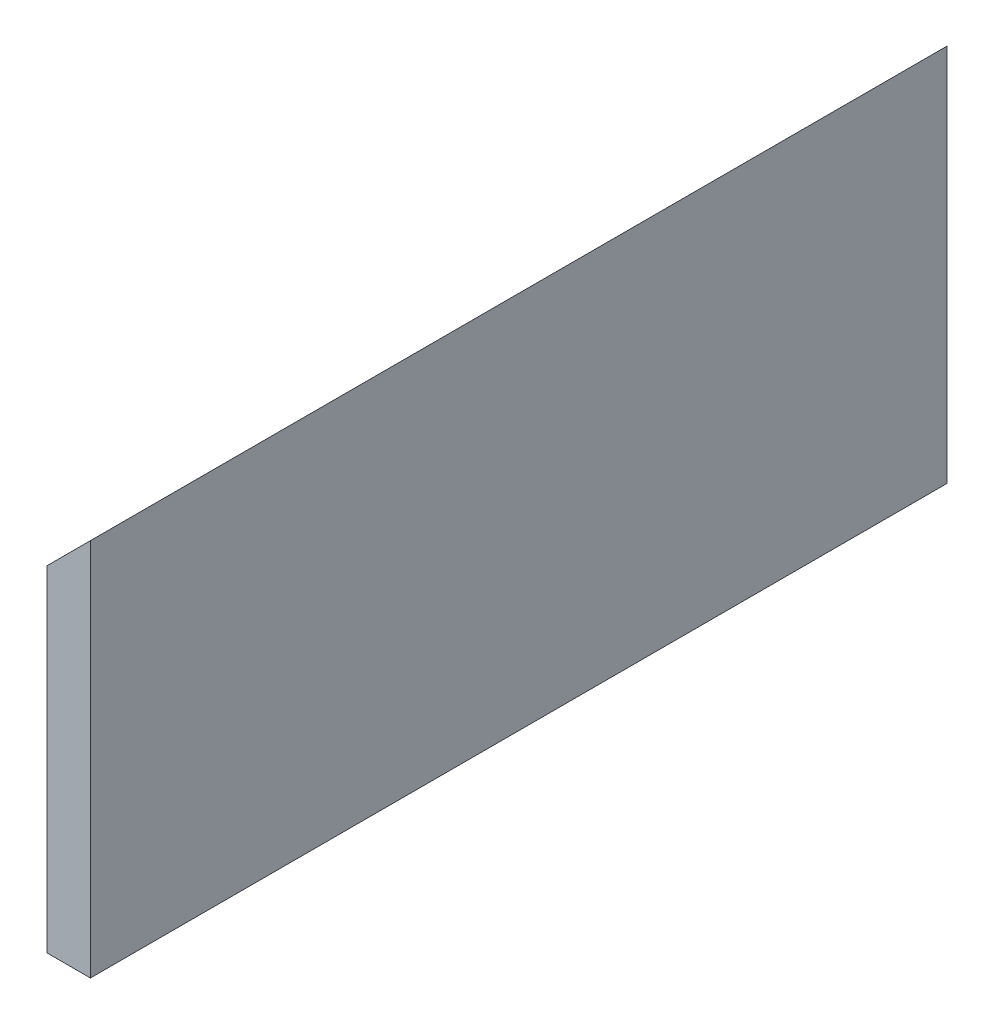
ISO-10303-21;
HEADER;
FILE_DESCRIPTION(('STEP AP214'),'2;1');
FILE_NAME('part.step','',(''),(''),'','','');
FILE_SCHEMA(('AUTOMOTIVE_DESIGN { 1 0 10303 214 1 1 1 1 }'));
ENDSEC;
DATA;
#1=APPLICATION_CONTEXT('core data for automotive mechanical design processes');
#2=APPLICATION_PROTOCOL_DEFINITION('international standard','automotive_design',2000,#1);
#3=PRODUCT_CONTEXT('',#1,'mechanical');
#4=PRODUCT('Part','Part','',(#3));
#5=PRODUCT_RELATED_PRODUCT_CATEGORY('part','',(#4));
#6=PRODUCT_DEFINITION_FORMATION('','',#4);
#7=PRODUCT_DEFINITION_CONTEXT('part definition',#1,'design');
#8=PRODUCT_DEFINITION('design','',#6,#7);
#9=PRODUCT_DEFINITION_SHAPE('','',#8);
#10=(LENGTH_UNIT() NAMED_UNIT(*) SI_UNIT(.MILLI.,.METRE.));
#11=(NAMED_UNIT(*) PLANE_ANGLE_UNIT() SI_UNIT($,.RADIAN.));
#12=(NAMED_UNIT(*) SI_UNIT($,.STERADIAN.) SOLID_ANGLE_UNIT());
#13=UNCERTAINTY_MEASURE_WITH_UNIT(LENGTH_MEASURE(1.E-05),#10,'distance_accuracy_value','');
#14=(GEOMETRIC_REPRESENTATION_CONTEXT(3) GLOBAL_UNCERTAINTY_ASSIGNED_CONTEXT((#13)) GLOBAL_UNIT_ASSIGNED_CONTEXT((#10,
#11,#12)) REPRESENTATION_CONTEXT('',''));
#15=CARTESIAN_POINT('',(0.,0.,0.));
#16=DIRECTION('',(0.,0.,1.));
#17=DIRECTION('',(1.,0.,0.));
#18=AXIS2_PLACEMENT_3D('',#15,#16,#17);
#19=CARTESIAN_POINT('',(-315.25,170.063864628821,433.498888103984));
#20=DIRECTION('',(1.,0.,0.));
#21=DIRECTION('',(0.,0.,-1.));
#22=AXIS2_PLACEMENT_3D('',#19,#20,#21);
#23=PLANE('',#22);
#24=DIRECTION('',(0.,-1.,0.));
#25=VECTOR('',#24,1.);
#26=CARTESIAN_POINT('',(-315.25,170.063864628821,300.));
#27=LINE('',#26,#25);
#28=CARTESIAN_POINT('',(-315.25,170.063864628821,300.));
#29=VERTEX_POINT('',#28);
#30=CARTESIAN_POINT('',(-315.25,52.6888646288209,300.));
#31=VERTEX_POINT('',#30);
#32=EDGE_CURVE('E82',#29,#31,#27,.T.);
#33=ORIENTED_EDGE('',*,*,#32,.F.);
#34=DIRECTION('',(0.,0.,-1.));
#35=VECTOR('',#34,1.);
#36=CARTESIAN_POINT('',(-315.25,170.063864628821,433.498888103984));
#37=LINE('',#36,#35);
#38=CARTESIAN_POINT('',(-315.25,170.063864628821,0.));
#39=VERTEX_POINT('',#38);
#40=EDGE_CURVE('E36',#29,#39,#37,.T.);
#41=ORIENTED_EDGE('',*,*,#40,.T.);
#42=DIRECTION('',(0.,-1.,0.));
#43=VECTOR('',#42,1.);
#44=CARTESIAN_POINT('',(-315.25,170.063864628821,0.));
#45=LINE('',#44,#43);
#46=CARTESIAN_POINT('',(-315.25,52.6888646288209,0.));
#47=VERTEX_POINT('',#46);
#48=EDGE_CURVE('E80',#39,#47,#45,.T.);
#49=ORIENTED_EDGE('',*,*,#48,.T.);
#50=DIRECTION('',(0.,0.,-1.));
#51=VECTOR('',#50,1.);
#52=CARTESIAN_POINT('',(-315.25,52.6888646288209,433.498888103984));
#53=LINE('',#52,#51);
#54=EDGE_CURVE('E71',#31,#47,#53,.T.);
#55=ORIENTED_EDGE('',*,*,#54,.F.);
#56=EDGE_LOOP('',(#33,#41,#49,#55));
#57=FACE_BOUND('',#56,.T.);
#58=ADVANCED_FACE('F32',(#57),#23,.F.);
#59=CARTESIAN_POINT('',(-300.,52.6888646288209,433.498888103984));
#60=DIRECTION('',(0.,1.,0.));
#61=DIRECTION('',(0.,0.,1.));
#62=AXIS2_PLACEMENT_3D('',#59,#60,#61);
#63=PLANE('',#62);
#64=DIRECTION('',(1.,0.,0.));
#65=VECTOR('',#64,1.);
#66=CARTESIAN_POINT('',(-300.,52.6888646288209,300.));
#67=LINE('',#66,#65);
#68=CARTESIAN_POINT('',(-300.,52.6888646288209,300.));
#69=VERTEX_POINT('',#68);
#70=EDGE_CURVE('E41',#31,#69,#67,.T.);
#71=ORIENTED_EDGE('',*,*,#70,.F.);
#72=ORIENTED_EDGE('',*,*,#54,.T.);
#73=DIRECTION('',(1.,0.,0.));
#74=VECTOR('',#73,1.);
#75=CARTESIAN_POINT('',(-300.,52.6888646288209,0.));
#76=LINE('',#75,#74);
#77=CARTESIAN_POINT('',(-300.,52.6888646288209,0.));
#78=VERTEX_POINT('',#77);
#79=EDGE_CURVE('E92',#47,#78,#76,.T.);
#80=ORIENTED_EDGE('',*,*,#79,.T.);
#81=DIRECTION('',(0.,0.,-1.));
#82=VECTOR('',#81,1.);
#83=CARTESIAN_POINT('',(-300.,52.6888646288209,433.498888103984));
#84=LINE('',#83,#82);
#85=EDGE_CURVE('E101',#69,#78,#84,.T.);
#86=ORIENTED_EDGE('',*,*,#85,.F.);
#87=EDGE_LOOP('',(#71,#72,#80,#86));
#88=FACE_BOUND('',#87,.T.);
#89=ADVANCED_FACE('F105',(#88),#63,.F.);
#90=CARTESIAN_POINT('',(-300.,185.313864628821,433.498888103984));
#91=DIRECTION('',(-1.,0.,0.));
#92=DIRECTION('',(0.,0.,1.));
#93=AXIS2_PLACEMENT_3D('',#90,#91,#92);
#94=PLANE('',#93);
#95=DIRECTION('',(0.,1.,0.));
#96=VECTOR('',#95,1.);
#97=CARTESIAN_POINT('',(-300.,185.313864628821,300.));
#98=LINE('',#97,#96);
#99=CARTESIAN_POINT('',(-300.,185.313864628821,300.));
#100=VERTEX_POINT('',#99);
#101=EDGE_CURVE('E11',#69,#100,#98,.T.);
#102=ORIENTED_EDGE('',*,*,#101,.F.);
#103=ORIENTED_EDGE('',*,*,#85,.T.);
#104=DIRECTION('',(0.,1.,0.));
#105=VECTOR('',#104,1.);
#106=CARTESIAN_POINT('',(-300.,185.313864628821,0.));
#107=LINE('',#106,#105);
#108=CARTESIAN_POINT('',(-300.,185.313864628821,0.));
#109=VERTEX_POINT('',#108);
#110=EDGE_CURVE('E102',#78,#109,#107,.T.);
#111=ORIENTED_EDGE('',*,*,#110,.T.);
#112=DIRECTION('',(0.,0.,-1.));
#113=VECTOR('',#112,1.);
#114=CARTESIAN_POINT('',(-300.,185.313864628821,433.498888103984));
#115=LINE('',#114,#113);
#116=EDGE_CURVE('E54',#100,#109,#115,.T.);
#117=ORIENTED_EDGE('',*,*,#116,.F.);
#118=EDGE_LOOP('',(#102,#103,#111,#117));
#119=FACE_BOUND('',#118,.T.);
#120=ADVANCED_FACE('F104',(#119),#94,.F.);
#121=CARTESIAN_POINT('',(-315.25,170.063864628821,433.498888103984));
#122=DIRECTION('',(0.70710678118655,-0.707106781186545,0.));
#123=DIRECTION('',(0.707106781186545,0.70710678118655,0.));
#124=AXIS2_PLACEMENT_3D('',#121,#122,#123);
#125=PLANE('',#124);
#126=DIRECTION('',(-0.707106781186545,-0.70710678118655,0.));
#127=VECTOR('',#126,1.);
#128=CARTESIAN_POINT('',(-315.25,170.063864628821,300.));
#129=LINE('',#128,#127);
#130=EDGE_CURVE('E89',#100,#29,#129,.T.);
#131=ORIENTED_EDGE('',*,*,#130,.F.);
#132=ORIENTED_EDGE('',*,*,#116,.T.);
#133=DIRECTION('',(-0.707106781186545,-0.70710678118655,0.));
#134=VECTOR('',#133,1.);
#135=CARTESIAN_POINT('',(-315.25,170.063864628821,0.));
#136=LINE('',#135,#134);
#137=EDGE_CURVE('E85',#109,#39,#136,.T.);
#138=ORIENTED_EDGE('',*,*,#137,.T.);
#139=ORIENTED_EDGE('',*,*,#40,.F.);
#140=EDGE_LOOP('',(#131,#132,#138,#139));
#141=FACE_BOUND('',#140,.T.);
#142=ADVANCED_FACE('F86',(#141),#125,.F.);
#143=CARTESIAN_POINT('',(0.,0.,0.));
#144=DIRECTION('',(0.,0.,-1.));
#145=DIRECTION('',(-1.,0.,0.));
#146=AXIS2_PLACEMENT_3D('',#143,#144,#145);
#147=PLANE('',#146);
#148=ORIENTED_EDGE('',*,*,#48,.F.);
#149=ORIENTED_EDGE('',*,*,#137,.F.);
#150=ORIENTED_EDGE('',*,*,#110,.F.);
#151=ORIENTED_EDGE('',*,*,#79,.F.);
#152=EDGE_LOOP('',(#148,#149,#150,#151));
#153=FACE_BOUND('',#152,.T.);
#154=ADVANCED_FACE('F91',(#153),#147,.T.);
#155=CARTESIAN_POINT('',(-465.25,185.313864628821,300.));
#156=DIRECTION('',(0.,0.,1.));
#157=DIRECTION('',(0.,1.,0.));
#158=AXIS2_PLACEMENT_3D('',#155,#156,#157);
#159=PLANE('',#158);
#160=ORIENTED_EDGE('',*,*,#130,.T.);
#161=ORIENTED_EDGE('',*,*,#32,.T.);
#162=ORIENTED_EDGE('',*,*,#70,.T.);
#163=ORIENTED_EDGE('',*,*,#101,.T.);
#164=EDGE_LOOP('',(#160,#161,#162,#163));
#165=FACE_BOUND('',#164,.T.);
#166=ADVANCED_FACE('F34',(#165),#159,.T.);
#167=CLOSED_SHELL('',(#58,#89,#120,#142,#154,#166));
#168=MANIFOLD_SOLID_BREP('B2',#167);
#169=ADVANCED_BREP_SHAPE_REPRESENTATION('',(#18,#168),#14);
#170=SHAPE_DEFINITION_REPRESENTATION(#9,#169);
ENDSEC;
END-ISO-10303-21;
